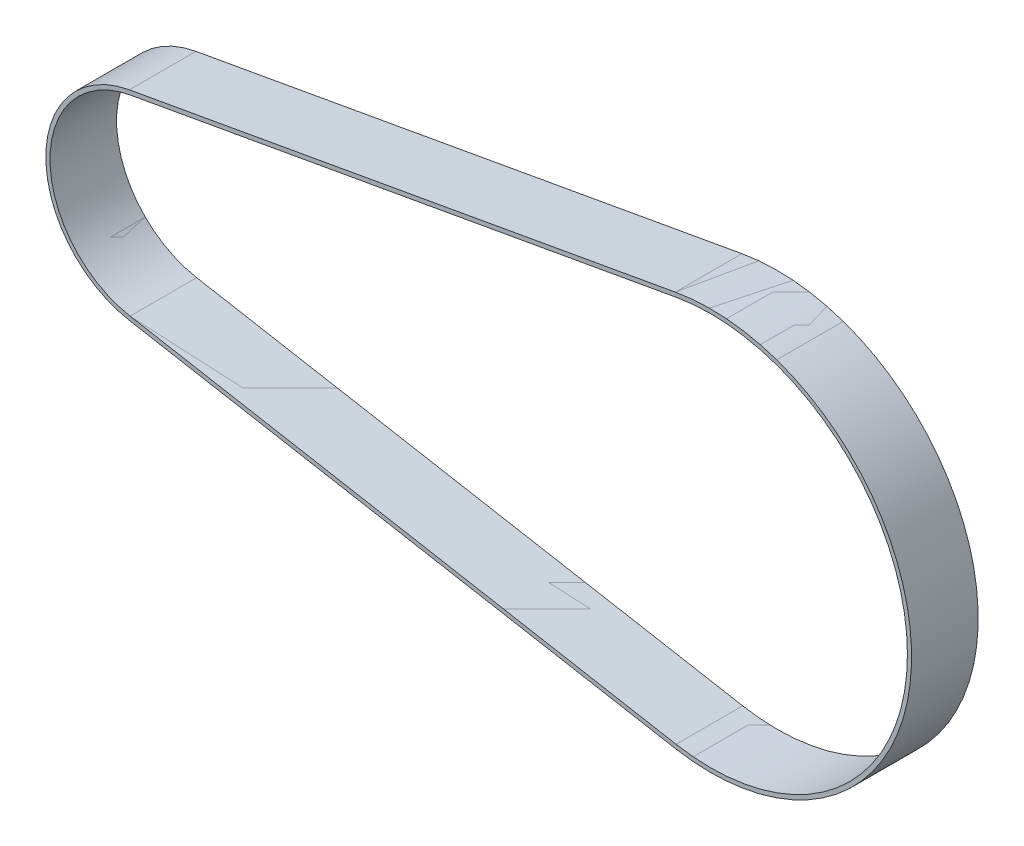
ISO-10303-21;
HEADER;
FILE_DESCRIPTION(('STEP AP214'),'2;1');
FILE_NAME('part.step','',(''),(''),'','','');
FILE_SCHEMA(('AUTOMOTIVE_DESIGN { 1 0 10303 214 1 1 1 1 }'));
ENDSEC;
DATA;
#1=APPLICATION_CONTEXT('core data for automotive mechanical design processes');
#2=APPLICATION_PROTOCOL_DEFINITION('international standard','automotive_design',2000,#1);
#3=PRODUCT_CONTEXT('',#1,'mechanical');
#4=PRODUCT('Part','Part','',(#3));
#5=PRODUCT_RELATED_PRODUCT_CATEGORY('part','',(#4));
#6=PRODUCT_DEFINITION_FORMATION('','',#4);
#7=PRODUCT_DEFINITION_CONTEXT('part definition',#1,'design');
#8=PRODUCT_DEFINITION('design','',#6,#7);
#9=PRODUCT_DEFINITION_SHAPE('','',#8);
#10=(LENGTH_UNIT() NAMED_UNIT(*) SI_UNIT(.MILLI.,.METRE.));
#11=(NAMED_UNIT(*) PLANE_ANGLE_UNIT() SI_UNIT($,.RADIAN.));
#12=(NAMED_UNIT(*) SI_UNIT($,.STERADIAN.) SOLID_ANGLE_UNIT());
#13=UNCERTAINTY_MEASURE_WITH_UNIT(LENGTH_MEASURE(1.E-05),#10,'distance_accuracy_value','');
#14=(GEOMETRIC_REPRESENTATION_CONTEXT(3) GLOBAL_UNCERTAINTY_ASSIGNED_CONTEXT((#13)) GLOBAL_UNIT_ASSIGNED_CONTEXT((#10,
#11,#12)) REPRESENTATION_CONTEXT('',''));
#15=CARTESIAN_POINT('',(0.,0.,0.));
#16=DIRECTION('',(0.,0.,1.));
#17=DIRECTION('',(1.,0.,0.));
#18=AXIS2_PLACEMENT_3D('',#15,#16,#17);
#19=CARTESIAN_POINT('',(-139.511111971968,-23.0070095015441,8.));
#20=DIRECTION('',(-0.176329803443982,-0.984331143679507,0.));
#21=DIRECTION('',(0.984331143679507,-0.176329803443982,0.));
#22=AXIS2_PLACEMENT_3D('',#19,#20,#21);
#23=PLANE('',#22);
#24=DIRECTION('',(-0.984331143679507,0.176329803443981,0.));
#25=VECTOR('',#24,1.);
#26=CARTESIAN_POINT('',(-139.511111971968,-23.0070095015441,-8.));
#27=LINE('',#26,#25);
#28=CARTESIAN_POINT('',(-8.3309630480376,-46.5061845749279,-8.));
#29=VERTEX_POINT('',#28);
#30=CARTESIAN_POINT('',(-139.511111971968,-23.0070095015441,-8.));
#31=VERTEX_POINT('',#30);
#32=EDGE_CURVE('E52',#29,#31,#27,.T.);
#33=ORIENTED_EDGE('',*,*,#32,.T.);
#34=DIRECTION('',(0.,0.,-1.));
#35=VECTOR('',#34,1.);
#36=CARTESIAN_POINT('',(-139.511111971968,-23.0070095015441,8.));
#37=LINE('',#36,#35);
#38=CARTESIAN_POINT('',(-139.511111971968,-23.0070095015441,8.));
#39=VERTEX_POINT('',#38);
#40=EDGE_CURVE('E101',#39,#31,#37,.T.);
#41=ORIENTED_EDGE('',*,*,#40,.F.);
#42=DIRECTION('',(-0.984331143679507,0.176329803443981,0.));
#43=VECTOR('',#42,1.);
#44=CARTESIAN_POINT('',(-139.511111971968,-23.0070095015441,8.));
#45=LINE('',#44,#43);
#46=CARTESIAN_POINT('',(-8.3309630480376,-46.5061845749279,8.));
#47=VERTEX_POINT('',#46);
#48=EDGE_CURVE('E12',#47,#39,#45,.T.);
#49=ORIENTED_EDGE('',*,*,#48,.F.);
#50=DIRECTION('',(0.,0.,-1.));
#51=VECTOR('',#50,1.);
#52=CARTESIAN_POINT('',(-8.3309630480376,-46.5061845749279,8.));
#53=LINE('',#52,#51);
#54=EDGE_CURVE('E87',#47,#29,#53,.T.);
#55=ORIENTED_EDGE('',*,*,#54,.T.);
#56=EDGE_LOOP('',(#33,#41,#49,#55));
#57=FACE_BOUND('',#56,.T.);
#58=ADVANCED_FACE('F46',(#57),#23,.F.);
#59=CARTESIAN_POINT('',(-135.38971289881,0.,8.));
#60=DIRECTION('',(0.,0.,-1.));
#61=DIRECTION('',(-1.,0.,0.));
#62=AXIS2_PLACEMENT_3D('',#59,#60,#61);
#63=CYLINDRICAL_SURFACE('',#62,23.3732414637843);
#64=CARTESIAN_POINT('',(-135.38971289881,0.,-8.));
#65=DIRECTION('',(0.,0.,-1.));
#66=DIRECTION('',(1.,0.,0.));
#67=AXIS2_PLACEMENT_3D('',#64,#65,#66);
#68=CIRCLE('',#67,23.3732414637843);
#69=CARTESIAN_POINT('',(-139.511111971968,23.0070095015441,-8.));
#70=VERTEX_POINT('',#69);
#71=EDGE_CURVE('E56',#31,#70,#68,.T.);
#72=ORIENTED_EDGE('',*,*,#71,.T.);
#73=DIRECTION('',(0.,0.,-1.));
#74=VECTOR('',#73,1.);
#75=CARTESIAN_POINT('',(-139.511111971968,23.0070095015441,8.));
#76=LINE('',#75,#74);
#77=CARTESIAN_POINT('',(-139.511111971968,23.0070095015441,8.));
#78=VERTEX_POINT('',#77);
#79=EDGE_CURVE('E110',#78,#70,#76,.T.);
#80=ORIENTED_EDGE('',*,*,#79,.F.);
#81=CARTESIAN_POINT('',(-135.38971289881,0.,8.));
#82=DIRECTION('',(0.,0.,-1.));
#83=DIRECTION('',(1.,0.,0.));
#84=AXIS2_PLACEMENT_3D('',#81,#82,#83);
#85=CIRCLE('',#84,23.3732414637843);
#86=EDGE_CURVE('E63',#39,#78,#85,.T.);
#87=ORIENTED_EDGE('',*,*,#86,.F.);
#88=ORIENTED_EDGE('',*,*,#40,.T.);
#89=EDGE_LOOP('',(#72,#80,#87,#88));
#90=FACE_BOUND('',#89,.T.);
#91=ADVANCED_FACE('F126',(#90),#63,.F.);
#92=CARTESIAN_POINT('',(-8.33096304803759,46.5061845749279,8.));
#93=DIRECTION('',(-0.176329803443981,0.984331143679507,0.));
#94=DIRECTION('',(-0.984331143679507,-0.176329803443981,0.));
#95=AXIS2_PLACEMENT_3D('',#92,#93,#94);
#96=PLANE('',#95);
#97=DIRECTION('',(0.984331143679507,0.176329803443981,0.));
#98=VECTOR('',#97,1.);
#99=CARTESIAN_POINT('',(-8.33096304803759,46.5061845749279,-8.));
#100=LINE('',#99,#98);
#101=CARTESIAN_POINT('',(-8.33096304803759,46.5061845749279,-8.));
#102=VERTEX_POINT('',#101);
#103=EDGE_CURVE('E117',#70,#102,#100,.T.);
#104=ORIENTED_EDGE('',*,*,#103,.T.);
#105=DIRECTION('',(0.,0.,-1.));
#106=VECTOR('',#105,1.);
#107=CARTESIAN_POINT('',(-8.33096304803759,46.5061845749279,8.));
#108=LINE('',#107,#106);
#109=CARTESIAN_POINT('',(-8.33096304803759,46.5061845749279,8.));
#110=VERTEX_POINT('',#109);
#111=EDGE_CURVE('E90',#110,#102,#108,.T.);
#112=ORIENTED_EDGE('',*,*,#111,.F.);
#113=DIRECTION('',(0.984331143679507,0.176329803443981,0.));
#114=VECTOR('',#113,1.);
#115=CARTESIAN_POINT('',(-8.33096304803759,46.5061845749279,8.));
#116=LINE('',#115,#114);
#117=EDGE_CURVE('E113',#78,#110,#116,.T.);
#118=ORIENTED_EDGE('',*,*,#117,.F.);
#119=ORIENTED_EDGE('',*,*,#79,.T.);
#120=EDGE_LOOP('',(#104,#112,#118,#119));
#121=FACE_BOUND('',#120,.T.);
#122=ADVANCED_FACE('F125',(#121),#96,.F.);
#123=CARTESIAN_POINT('',(0.,0.,8.));
#124=DIRECTION('',(0.,0.,-1.));
#125=DIRECTION('',(-1.,0.,0.));
#126=AXIS2_PLACEMENT_3D('',#123,#124,#125);
#127=CYLINDRICAL_SURFACE('',#126,47.2464829275686);
#128=CARTESIAN_POINT('',(0.,0.,-8.));
#129=DIRECTION('',(0.,0.,-1.));
#130=DIRECTION('',(1.,0.,0.));
#131=AXIS2_PLACEMENT_3D('',#128,#129,#130);
#132=CIRCLE('',#131,47.2464829275686);
#133=EDGE_CURVE('E84',#102,#29,#132,.T.);
#134=ORIENTED_EDGE('',*,*,#133,.T.);
#135=ORIENTED_EDGE('',*,*,#54,.F.);
#136=CARTESIAN_POINT('',(0.,0.,8.));
#137=DIRECTION('',(0.,0.,-1.));
#138=DIRECTION('',(1.,0.,0.));
#139=AXIS2_PLACEMENT_3D('',#136,#137,#138);
#140=CIRCLE('',#139,47.2464829275686);
#141=EDGE_CURVE('E98',#110,#47,#140,.T.);
#142=ORIENTED_EDGE('',*,*,#141,.F.);
#143=ORIENTED_EDGE('',*,*,#111,.T.);
#144=EDGE_LOOP('',(#134,#135,#142,#143));
#145=FACE_BOUND('',#144,.T.);
#146=ADVANCED_FACE('F86',(#145),#127,.F.);
#147=OPEN_SHELL('',(#58,#91,#122,#146));
#148=SHELL_BASED_SURFACE_MODEL('B2',(#147));
#149=CARTESIAN_POINT('',(-135.38971289881,0.,8.));
#150=DIRECTION('',(0.,0.,-1.));
#151=DIRECTION('',(-1.,0.,0.));
#152=AXIS2_PLACEMENT_3D('',#149,#150,#151);
#153=CYLINDRICAL_SURFACE('',#152,24.3732414637843);
#154=CARTESIAN_POINT('',(-135.38971289881,0.,-8.));
#155=DIRECTION('',(0.,0.,-1.));
#156=DIRECTION('',(-1.,0.,0.));
#157=AXIS2_PLACEMENT_3D('',#154,#155,#156);
#158=CIRCLE('',#157,24.3732414637843);
#159=CARTESIAN_POINT('',(-139.687441775412,-23.9913406452236,-8.));
#160=VERTEX_POINT('',#159);
#161=CARTESIAN_POINT('',(-139.687441775412,23.9913406452236,-8.));
#162=VERTEX_POINT('',#161);
#163=EDGE_CURVE('E187',#160,#162,#158,.T.);
#164=ORIENTED_EDGE('',*,*,#163,.F.);
#165=DIRECTION('',(0.,0.,-1.));
#166=VECTOR('',#165,1.);
#167=CARTESIAN_POINT('',(-139.687441775412,-23.9913406452236,8.));
#168=LINE('',#167,#166);
#169=CARTESIAN_POINT('',(-139.687441775412,-23.9913406452236,8.));
#170=VERTEX_POINT('',#169);
#171=EDGE_CURVE('E236',#170,#160,#168,.T.);
#172=ORIENTED_EDGE('',*,*,#171,.F.);
#173=CARTESIAN_POINT('',(-135.38971289881,0.,8.));
#174=DIRECTION('',(0.,0.,-1.));
#175=DIRECTION('',(-1.,0.,0.));
#176=AXIS2_PLACEMENT_3D('',#173,#174,#175);
#177=CIRCLE('',#176,24.3732414637843);
#178=CARTESIAN_POINT('',(-139.687441775412,23.9913406452236,8.));
#179=VERTEX_POINT('',#178);
#180=EDGE_CURVE('E44',#170,#179,#177,.T.);
#181=ORIENTED_EDGE('',*,*,#180,.T.);
#182=DIRECTION('',(0.,0.,-1.));
#183=VECTOR('',#182,1.);
#184=CARTESIAN_POINT('',(-139.687441775412,23.9913406452236,8.));
#185=LINE('',#184,#183);
#186=EDGE_CURVE('E222',#179,#162,#185,.T.);
#187=ORIENTED_EDGE('',*,*,#186,.T.);
#188=EDGE_LOOP('',(#164,#172,#181,#187));
#189=FACE_BOUND('',#188,.T.);
#190=ADVANCED_FACE('F181',(#189),#153,.T.);
#191=CARTESIAN_POINT('',(-8.50729285148157,-47.4905157186074,8.));
#192=DIRECTION('',(-0.176329803443982,-0.984331143679507,0.));
#193=DIRECTION('',(0.984331143679507,-0.176329803443982,0.));
#194=AXIS2_PLACEMENT_3D('',#191,#192,#193);
#195=PLANE('',#194);
#196=DIRECTION('',(-0.984331143679507,0.176329803443982,0.));
#197=VECTOR('',#196,1.);
#198=CARTESIAN_POINT('',(-8.50729285148157,-47.4905157186074,-8.));
#199=LINE('',#198,#197);
#200=CARTESIAN_POINT('',(-8.50729285148157,-47.4905157186074,-8.));
#201=VERTEX_POINT('',#200);
#202=EDGE_CURVE('E191',#201,#160,#199,.T.);
#203=ORIENTED_EDGE('',*,*,#202,.F.);
#204=DIRECTION('',(0.,0.,-1.));
#205=VECTOR('',#204,1.);
#206=CARTESIAN_POINT('',(-8.50729285148157,-47.4905157186074,8.));
#207=LINE('',#206,#205);
#208=CARTESIAN_POINT('',(-8.50729285148157,-47.4905157186074,8.));
#209=VERTEX_POINT('',#208);
#210=EDGE_CURVE('E245',#209,#201,#207,.T.);
#211=ORIENTED_EDGE('',*,*,#210,.F.);
#212=DIRECTION('',(-0.984331143679507,0.176329803443982,0.));
#213=VECTOR('',#212,1.);
#214=CARTESIAN_POINT('',(-8.50729285148157,-47.4905157186074,8.));
#215=LINE('',#214,#213);
#216=EDGE_CURVE('E198',#209,#170,#215,.T.);
#217=ORIENTED_EDGE('',*,*,#216,.T.);
#218=ORIENTED_EDGE('',*,*,#171,.T.);
#219=EDGE_LOOP('',(#203,#211,#217,#218));
#220=FACE_BOUND('',#219,.T.);
#221=ADVANCED_FACE('F261',(#220),#195,.T.);
#222=CARTESIAN_POINT('',(0.,0.,8.));
#223=DIRECTION('',(0.,0.,-1.));
#224=DIRECTION('',(-1.,0.,0.));
#225=AXIS2_PLACEMENT_3D('',#222,#223,#224);
#226=CYLINDRICAL_SURFACE('',#225,48.2464829275686);
#227=CARTESIAN_POINT('',(0.,0.,-8.));
#228=DIRECTION('',(0.,0.,-1.));
#229=DIRECTION('',(-1.,0.,0.));
#230=AXIS2_PLACEMENT_3D('',#227,#228,#229);
#231=CIRCLE('',#230,48.2464829275686);
#232=CARTESIAN_POINT('',(-8.5072928514816,47.4905157186075,-8.));
#233=VERTEX_POINT('',#232);
#234=EDGE_CURVE('E251',#233,#201,#231,.T.);
#235=ORIENTED_EDGE('',*,*,#234,.F.);
#236=DIRECTION('',(0.,0.,-1.));
#237=VECTOR('',#236,1.);
#238=CARTESIAN_POINT('',(-8.5072928514816,47.4905157186075,8.));
#239=LINE('',#238,#237);
#240=CARTESIAN_POINT('',(-8.5072928514816,47.4905157186075,8.));
#241=VERTEX_POINT('',#240);
#242=EDGE_CURVE('E225',#241,#233,#239,.T.);
#243=ORIENTED_EDGE('',*,*,#242,.F.);
#244=CARTESIAN_POINT('',(0.,0.,8.));
#245=DIRECTION('',(0.,0.,-1.));
#246=DIRECTION('',(-1.,0.,0.));
#247=AXIS2_PLACEMENT_3D('',#244,#245,#246);
#248=CIRCLE('',#247,48.2464829275686);
#249=EDGE_CURVE('E248',#241,#209,#248,.T.);
#250=ORIENTED_EDGE('',*,*,#249,.T.);
#251=ORIENTED_EDGE('',*,*,#210,.T.);
#252=EDGE_LOOP('',(#235,#243,#250,#251));
#253=FACE_BOUND('',#252,.T.);
#254=ADVANCED_FACE('F260',(#253),#226,.T.);
#255=CARTESIAN_POINT('',(-139.687441775412,23.9913406452236,8.));
#256=DIRECTION('',(-0.176329803443982,0.984331143679507,0.));
#257=DIRECTION('',(-0.984331143679507,-0.176329803443982,0.));
#258=AXIS2_PLACEMENT_3D('',#255,#256,#257);
#259=PLANE('',#258);
#260=DIRECTION('',(0.984331143679507,0.176329803443982,0.));
#261=VECTOR('',#260,1.);
#262=CARTESIAN_POINT('',(-139.687441775412,23.9913406452236,-8.));
#263=LINE('',#262,#261);
#264=EDGE_CURVE('E219',#162,#233,#263,.T.);
#265=ORIENTED_EDGE('',*,*,#264,.F.);
#266=ORIENTED_EDGE('',*,*,#186,.F.);
#267=DIRECTION('',(0.984331143679507,0.176329803443982,0.));
#268=VECTOR('',#267,1.);
#269=CARTESIAN_POINT('',(-139.687441775412,23.9913406452236,8.));
#270=LINE('',#269,#268);
#271=EDGE_CURVE('E233',#179,#241,#270,.T.);
#272=ORIENTED_EDGE('',*,*,#271,.T.);
#273=ORIENTED_EDGE('',*,*,#242,.T.);
#274=EDGE_LOOP('',(#265,#266,#272,#273));
#275=FACE_BOUND('',#274,.T.);
#276=ADVANCED_FACE('F221',(#275),#259,.T.);
#277=OPEN_SHELL('',(#190,#221,#254,#276));
#278=SHELL_BASED_SURFACE_MODEL('B6',(#277));
#279=CARTESIAN_POINT('',(0.,0.,8.));
#280=DIRECTION('',(0.,0.,-1.));
#281=DIRECTION('',(-1.,0.,0.));
#282=AXIS2_PLACEMENT_3D('',#279,#280,#281);
#283=CYLINDRICAL_SURFACE('',#282,48.2464829275686);
#284=CARTESIAN_POINT('',(0.,0.,-8.));
#285=DIRECTION('',(0.,0.,-1.));
#286=DIRECTION('',(-1.,0.,0.));
#287=AXIS2_PLACEMENT_3D('',#284,#285,#286);
#288=CIRCLE('',#287,48.2464829275686);
#289=CARTESIAN_POINT('',(-8.5072928514816,47.4905157186075,-8.));
#290=VERTEX_POINT('',#289);
#291=CARTESIAN_POINT('',(-8.50729285148157,-47.4905157186074,-8.));
#292=VERTEX_POINT('',#291);
#293=EDGE_CURVE('E405',#290,#292,#288,.T.);
#294=ORIENTED_EDGE('',*,*,#293,.F.);
#295=DIRECTION('',(0.,0.,-1.));
#296=VECTOR('',#295,1.);
#297=CARTESIAN_POINT('',(-8.5072928514816,47.4905157186075,8.));
#298=LINE('',#297,#296);
#299=CARTESIAN_POINT('',(-8.5072928514816,47.4905157186075,8.));
#300=VERTEX_POINT('',#299);
#301=EDGE_CURVE('E179',#300,#290,#298,.T.);
#302=ORIENTED_EDGE('',*,*,#301,.F.);
#303=CARTESIAN_POINT('',(0.,0.,8.));
#304=DIRECTION('',(0.,0.,-1.));
#305=DIRECTION('',(-1.,0.,0.));
#306=AXIS2_PLACEMENT_3D('',#303,#304,#305);
#307=CIRCLE('',#306,48.2464829275686);
#308=CARTESIAN_POINT('',(-8.50729285148157,-47.4905157186074,8.));
#309=VERTEX_POINT('',#308);
#310=EDGE_CURVE('E409',#300,#309,#307,.T.);
#311=ORIENTED_EDGE('',*,*,#310,.T.);
#312=DIRECTION('',(0.,0.,-1.));
#313=VECTOR('',#312,1.);
#314=CARTESIAN_POINT('',(-8.50729285148157,-47.4905157186074,8.));
#315=LINE('',#314,#313);
#316=EDGE_CURVE('E310',#309,#292,#315,.T.);
#317=ORIENTED_EDGE('',*,*,#316,.T.);
#318=EDGE_LOOP('',(#294,#302,#311,#317));
#319=FACE_BOUND('',#318,.T.);
#320=ADVANCED_FACE('F307',(#319),#283,.T.);
#321=CARTESIAN_POINT('',(-139.687441775412,23.9913406452236,8.));
#322=DIRECTION('',(-0.176329803443982,0.984331143679507,0.));
#323=DIRECTION('',(-0.984331143679507,-0.176329803443982,0.));
#324=AXIS2_PLACEMENT_3D('',#321,#322,#323);
#325=PLANE('',#324);
#326=DIRECTION('',(0.984331143679507,0.176329803443982,0.));
#327=VECTOR('',#326,1.);
#328=CARTESIAN_POINT('',(-139.687441775412,23.9913406452236,-8.));
#329=LINE('',#328,#327);
#330=CARTESIAN_POINT('',(-139.687441775412,23.9913406452236,-8.));
#331=VERTEX_POINT('',#330);
#332=EDGE_CURVE('E413',#331,#290,#329,.T.);
#333=ORIENTED_EDGE('',*,*,#332,.F.);
#334=DIRECTION('',(0.,0.,-1.));
#335=VECTOR('',#334,1.);
#336=CARTESIAN_POINT('',(-139.687441775412,23.9913406452236,8.));
#337=LINE('',#336,#335);
#338=CARTESIAN_POINT('',(-139.687441775412,23.9913406452236,8.));
#339=VERTEX_POINT('',#338);
#340=EDGE_CURVE('E315',#339,#331,#337,.T.);
#341=ORIENTED_EDGE('',*,*,#340,.F.);
#342=DIRECTION('',(0.984331143679507,0.176329803443982,0.));
#343=VECTOR('',#342,1.);
#344=CARTESIAN_POINT('',(-139.687441775412,23.9913406452236,8.));
#345=LINE('',#344,#343);
#346=EDGE_CURVE('E419',#339,#300,#345,.T.);
#347=ORIENTED_EDGE('',*,*,#346,.T.);
#348=ORIENTED_EDGE('',*,*,#301,.T.);
#349=EDGE_LOOP('',(#333,#341,#347,#348));
#350=FACE_BOUND('',#349,.T.);
#351=ADVANCED_FACE('F445',(#350),#325,.T.);
#352=CARTESIAN_POINT('',(-135.38971289881,0.,8.));
#353=DIRECTION('',(0.,0.,-1.));
#354=DIRECTION('',(-1.,0.,0.));
#355=AXIS2_PLACEMENT_3D('',#352,#353,#354);
#356=CYLINDRICAL_SURFACE('',#355,24.3732414637843);
#357=CARTESIAN_POINT('',(-135.38971289881,0.,-8.));
#358=DIRECTION('',(0.,0.,-1.));
#359=DIRECTION('',(-1.,0.,0.));
#360=AXIS2_PLACEMENT_3D('',#357,#358,#359);
#361=CIRCLE('',#360,24.3732414637843);
#362=CARTESIAN_POINT('',(-139.687441775412,-23.9913406452236,-8.));
#363=VERTEX_POINT('',#362);
#364=EDGE_CURVE('E427',#363,#331,#361,.T.);
#365=ORIENTED_EDGE('',*,*,#364,.F.);
#366=DIRECTION('',(0.,0.,-1.));
#367=VECTOR('',#366,1.);
#368=CARTESIAN_POINT('',(-139.687441775412,-23.9913406452236,8.));
#369=LINE('',#368,#367);
#370=CARTESIAN_POINT('',(-139.687441775412,-23.9913406452236,8.));
#371=VERTEX_POINT('',#370);
#372=EDGE_CURVE('E432',#371,#363,#369,.T.);
#373=ORIENTED_EDGE('',*,*,#372,.F.);
#374=CARTESIAN_POINT('',(-135.38971289881,0.,8.));
#375=DIRECTION('',(0.,0.,-1.));
#376=DIRECTION('',(-1.,0.,0.));
#377=AXIS2_PLACEMENT_3D('',#374,#375,#376);
#378=CIRCLE('',#377,24.3732414637843);
#379=EDGE_CURVE('E416',#371,#339,#378,.T.);
#380=ORIENTED_EDGE('',*,*,#379,.T.);
#381=ORIENTED_EDGE('',*,*,#340,.T.);
#382=EDGE_LOOP('',(#365,#373,#380,#381));
#383=FACE_BOUND('',#382,.T.);
#384=ADVANCED_FACE('F449',(#383),#356,.T.);
#385=CARTESIAN_POINT('',(-8.50729285148157,-47.4905157186074,8.));
#386=DIRECTION('',(-0.176329803443982,-0.984331143679507,0.));
#387=DIRECTION('',(0.984331143679507,-0.176329803443982,0.));
#388=AXIS2_PLACEMENT_3D('',#385,#386,#387);
#389=PLANE('',#388);
#390=DIRECTION('',(-0.984331143679507,0.176329803443982,0.));
#391=VECTOR('',#390,1.);
#392=CARTESIAN_POINT('',(-8.50729285148157,-47.4905157186074,-8.));
#393=LINE('',#392,#391);
#394=EDGE_CURVE('E424',#292,#363,#393,.T.);
#395=ORIENTED_EDGE('',*,*,#394,.F.);
#396=ORIENTED_EDGE('',*,*,#316,.F.);
#397=DIRECTION('',(-0.984331143679507,0.176329803443982,0.));
#398=VECTOR('',#397,1.);
#399=CARTESIAN_POINT('',(-8.50729285148157,-47.4905157186074,8.));
#400=LINE('',#399,#398);
#401=EDGE_CURVE('E412',#309,#371,#400,.T.);
#402=ORIENTED_EDGE('',*,*,#401,.T.);
#403=ORIENTED_EDGE('',*,*,#372,.T.);
#404=EDGE_LOOP('',(#395,#396,#402,#403));
#405=FACE_BOUND('',#404,.T.);
#406=ADVANCED_FACE('F440',(#405),#389,.T.);
#407=CARTESIAN_POINT('',(0.,0.,8.));
#408=DIRECTION('',(0.,0.,-1.));
#409=DIRECTION('',(-1.,0.,0.));
#410=AXIS2_PLACEMENT_3D('',#407,#408,#409);
#411=PLANE('',#410);
#412=DIRECTION('',(0.984331143679507,0.176329803443981,0.));
#413=VECTOR('',#412,1.);
#414=CARTESIAN_POINT('',(-8.33096304803759,46.5061845749279,8.));
#415=LINE('',#414,#413);
#416=CARTESIAN_POINT('',(-139.511111971968,23.0070095015441,8.));
#417=VERTEX_POINT('',#416);
#418=CARTESIAN_POINT('',(-8.33096304803759,46.5061845749279,8.));
#419=VERTEX_POINT('',#418);
#420=EDGE_CURVE('E380',#417,#419,#415,.T.);
#421=ORIENTED_EDGE('',*,*,#420,.T.);
#422=CARTESIAN_POINT('',(0.,0.,8.));
#423=DIRECTION('',(0.,0.,-1.));
#424=DIRECTION('',(1.,0.,0.));
#425=AXIS2_PLACEMENT_3D('',#422,#423,#424);
#426=CIRCLE('',#425,47.2464829275686);
#427=CARTESIAN_POINT('',(-8.3309630480376,-46.5061845749279,8.));
#428=VERTEX_POINT('',#427);
#429=EDGE_CURVE('E374',#419,#428,#426,.T.);
#430=ORIENTED_EDGE('',*,*,#429,.T.);
#431=DIRECTION('',(-0.984331143679507,0.176329803443981,0.));
#432=VECTOR('',#431,1.);
#433=CARTESIAN_POINT('',(-139.511111971968,-23.0070095015441,8.));
#434=LINE('',#433,#432);
#435=CARTESIAN_POINT('',(-139.511111971968,-23.0070095015441,8.));
#436=VERTEX_POINT('',#435);
#437=EDGE_CURVE('E383',#428,#436,#434,.T.);
#438=ORIENTED_EDGE('',*,*,#437,.T.);
#439=CARTESIAN_POINT('',(-135.38971289881,0.,8.));
#440=DIRECTION('',(0.,0.,-1.));
#441=DIRECTION('',(1.,0.,0.));
#442=AXIS2_PLACEMENT_3D('',#439,#440,#441);
#443=CIRCLE('',#442,23.3732414637843);
#444=EDGE_CURVE('E323',#436,#417,#443,.T.);
#445=ORIENTED_EDGE('',*,*,#444,.T.);
#446=EDGE_LOOP('',(#421,#430,#438,#445));
#447=FACE_BOUND('',#446,.T.);
#448=ORIENTED_EDGE('',*,*,#310,.F.);
#449=ORIENTED_EDGE('',*,*,#346,.F.);
#450=ORIENTED_EDGE('',*,*,#379,.F.);
#451=ORIENTED_EDGE('',*,*,#401,.F.);
#452=EDGE_LOOP('',(#448,#449,#450,#451));
#453=FACE_BOUND('',#452,.T.);
#454=ADVANCED_FACE('F387',(#447,#453),#411,.F.);
#455=CARTESIAN_POINT('',(0.,0.,-8.));
#456=DIRECTION('',(0.,0.,-1.));
#457=DIRECTION('',(-1.,0.,0.));
#458=AXIS2_PLACEMENT_3D('',#455,#456,#457);
#459=PLANE('',#458);
#460=CARTESIAN_POINT('',(0.,0.,-8.));
#461=DIRECTION('',(0.,0.,-1.));
#462=DIRECTION('',(1.,0.,0.));
#463=AXIS2_PLACEMENT_3D('',#460,#461,#462);
#464=CIRCLE('',#463,47.2464829275686);
#465=CARTESIAN_POINT('',(-8.33096304803759,46.5061845749279,-8.));
#466=VERTEX_POINT('',#465);
#467=CARTESIAN_POINT('',(-8.3309630480376,-46.5061845749279,-8.));
#468=VERTEX_POINT('',#467);
#469=EDGE_CURVE('E331',#466,#468,#464,.T.);
#470=ORIENTED_EDGE('',*,*,#469,.F.);
#471=DIRECTION('',(0.984331143679507,0.176329803443981,0.));
#472=VECTOR('',#471,1.);
#473=CARTESIAN_POINT('',(-8.33096304803759,46.5061845749279,-8.));
#474=LINE('',#473,#472);
#475=CARTESIAN_POINT('',(-139.511111971968,23.0070095015441,-8.));
#476=VERTEX_POINT('',#475);
#477=EDGE_CURVE('E390',#476,#466,#474,.T.);
#478=ORIENTED_EDGE('',*,*,#477,.F.);
#479=CARTESIAN_POINT('',(-135.38971289881,0.,-8.));
#480=DIRECTION('',(0.,0.,-1.));
#481=DIRECTION('',(1.,0.,0.));
#482=AXIS2_PLACEMENT_3D('',#479,#480,#481);
#483=CIRCLE('',#482,23.3732414637843);
#484=CARTESIAN_POINT('',(-139.511111971968,-23.0070095015441,-8.));
#485=VERTEX_POINT('',#484);
#486=EDGE_CURVE('E393',#485,#476,#483,.T.);
#487=ORIENTED_EDGE('',*,*,#486,.F.);
#488=DIRECTION('',(-0.984331143679507,0.176329803443981,0.));
#489=VECTOR('',#488,1.);
#490=CARTESIAN_POINT('',(-139.511111971968,-23.0070095015441,-8.));
#491=LINE('',#490,#489);
#492=EDGE_CURVE('E399',#468,#485,#491,.T.);
#493=ORIENTED_EDGE('',*,*,#492,.F.);
#494=EDGE_LOOP('',(#470,#478,#487,#493));
#495=FACE_BOUND('',#494,.T.);
#496=ORIENTED_EDGE('',*,*,#293,.T.);
#497=ORIENTED_EDGE('',*,*,#394,.T.);
#498=ORIENTED_EDGE('',*,*,#364,.T.);
#499=ORIENTED_EDGE('',*,*,#332,.T.);
#500=EDGE_LOOP('',(#496,#497,#498,#499));
#501=FACE_BOUND('',#500,.T.);
#502=ADVANCED_FACE('F442',(#495,#501),#459,.T.);
#503=CARTESIAN_POINT('',(0.,0.,8.));
#504=DIRECTION('',(0.,0.,-1.));
#505=DIRECTION('',(-1.,0.,0.));
#506=AXIS2_PLACEMENT_3D('',#503,#504,#505);
#507=CYLINDRICAL_SURFACE('',#506,47.2464829275686);
#508=ORIENTED_EDGE('',*,*,#469,.T.);
#509=DIRECTION('',(0.,0.,-1.));
#510=VECTOR('',#509,1.);
#511=CARTESIAN_POINT('',(-8.3309630480376,-46.5061845749279,8.));
#512=LINE('',#511,#510);
#513=EDGE_CURVE('E370',#428,#468,#512,.T.);
#514=ORIENTED_EDGE('',*,*,#513,.F.);
#515=ORIENTED_EDGE('',*,*,#429,.F.);
#516=DIRECTION('',(0.,0.,-1.));
#517=VECTOR('',#516,1.);
#518=CARTESIAN_POINT('',(-8.33096304803759,46.5061845749279,8.));
#519=LINE('',#518,#517);
#520=EDGE_CURVE('E403',#419,#466,#519,.T.);
#521=ORIENTED_EDGE('',*,*,#520,.T.);
#522=EDGE_LOOP('',(#508,#514,#515,#521));
#523=FACE_BOUND('',#522,.T.);
#524=ADVANCED_FACE('F372',(#523),#507,.F.);
#525=CARTESIAN_POINT('',(-8.33096304803759,46.5061845749279,8.));
#526=DIRECTION('',(-0.176329803443981,0.984331143679507,0.));
#527=DIRECTION('',(-0.984331143679507,-0.176329803443981,0.));
#528=AXIS2_PLACEMENT_3D('',#525,#526,#527);
#529=PLANE('',#528);
#530=ORIENTED_EDGE('',*,*,#477,.T.);
#531=ORIENTED_EDGE('',*,*,#520,.F.);
#532=ORIENTED_EDGE('',*,*,#420,.F.);
#533=DIRECTION('',(0.,0.,-1.));
#534=VECTOR('',#533,1.);
#535=CARTESIAN_POINT('',(-139.511111971968,23.0070095015441,8.));
#536=LINE('',#535,#534);
#537=EDGE_CURVE('E406',#417,#476,#536,.T.);
#538=ORIENTED_EDGE('',*,*,#537,.T.);
#539=EDGE_LOOP('',(#530,#531,#532,#538));
#540=FACE_BOUND('',#539,.T.);
#541=ADVANCED_FACE('F500',(#540),#529,.F.);
#542=CARTESIAN_POINT('',(-135.38971289881,0.,8.));
#543=DIRECTION('',(0.,0.,-1.));
#544=DIRECTION('',(-1.,0.,0.));
#545=AXIS2_PLACEMENT_3D('',#542,#543,#544);
#546=CYLINDRICAL_SURFACE('',#545,23.3732414637843);
#547=ORIENTED_EDGE('',*,*,#486,.T.);
#548=ORIENTED_EDGE('',*,*,#537,.F.);
#549=ORIENTED_EDGE('',*,*,#444,.F.);
#550=DIRECTION('',(0.,0.,-1.));
#551=VECTOR('',#550,1.);
#552=CARTESIAN_POINT('',(-139.511111971968,-23.0070095015441,8.));
#553=LINE('',#552,#551);
#554=EDGE_CURVE('E379',#436,#485,#553,.T.);
#555=ORIENTED_EDGE('',*,*,#554,.T.);
#556=EDGE_LOOP('',(#547,#548,#549,#555));
#557=FACE_BOUND('',#556,.T.);
#558=ADVANCED_FACE('F509',(#557),#546,.F.);
#559=CARTESIAN_POINT('',(-139.511111971968,-23.0070095015441,8.));
#560=DIRECTION('',(-0.176329803443982,-0.984331143679507,0.));
#561=DIRECTION('',(0.984331143679507,-0.176329803443982,0.));
#562=AXIS2_PLACEMENT_3D('',#559,#560,#561);
#563=PLANE('',#562);
#564=ORIENTED_EDGE('',*,*,#492,.T.);
#565=ORIENTED_EDGE('',*,*,#554,.F.);
#566=ORIENTED_EDGE('',*,*,#437,.F.);
#567=ORIENTED_EDGE('',*,*,#513,.T.);
#568=EDGE_LOOP('',(#564,#565,#566,#567));
#569=FACE_BOUND('',#568,.T.);
#570=ADVANCED_FACE('F384',(#569),#563,.F.);
#571=CLOSED_SHELL('',(#320,#351,#384,#406,#454,#502,#524,#541,#558,#570));
#572=MANIFOLD_SOLID_BREP('B38',#571);
#573=ADVANCED_BREP_SHAPE_REPRESENTATION('',(#18,#572),#14);
#574=MANIFOLD_SURFACE_SHAPE_REPRESENTATION('',(#18,#148,#278),#14);
#575=SHAPE_REPRESENTATION('',(#18),#14);
#576=SHAPE_DEFINITION_REPRESENTATION(#9,#575);
#577=SHAPE_REPRESENTATION_RELATIONSHIP('','',#575,#573);
#578=SHAPE_REPRESENTATION_RELATIONSHIP('','',#575,#574);
ENDSEC;
END-ISO-10303-21;
